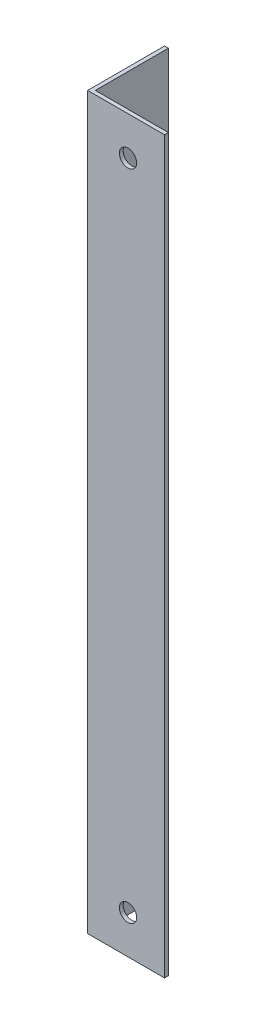
ISO-10303-21;
HEADER;
FILE_DESCRIPTION(('STEP AP214'),'2;1');
FILE_NAME('part.step','',(''),(''),'','','');
FILE_SCHEMA(('AUTOMOTIVE_DESIGN { 1 0 10303 214 1 1 1 1 }'));
ENDSEC;
DATA;
#1=APPLICATION_CONTEXT('core data for automotive mechanical design processes');
#2=APPLICATION_PROTOCOL_DEFINITION('international standard','automotive_design',2000,#1);
#3=PRODUCT_CONTEXT('',#1,'mechanical');
#4=PRODUCT('Part','Part','',(#3));
#5=PRODUCT_RELATED_PRODUCT_CATEGORY('part','',(#4));
#6=PRODUCT_DEFINITION_FORMATION('','',#4);
#7=PRODUCT_DEFINITION_CONTEXT('part definition',#1,'design');
#8=PRODUCT_DEFINITION('design','',#6,#7);
#9=PRODUCT_DEFINITION_SHAPE('','',#8);
#10=(LENGTH_UNIT() NAMED_UNIT(*) SI_UNIT(.MILLI.,.METRE.));
#11=(NAMED_UNIT(*) PLANE_ANGLE_UNIT() SI_UNIT($,.RADIAN.));
#12=(NAMED_UNIT(*) SI_UNIT($,.STERADIAN.) SOLID_ANGLE_UNIT());
#13=UNCERTAINTY_MEASURE_WITH_UNIT(LENGTH_MEASURE(1.E-05),#10,'distance_accuracy_value','');
#14=(GEOMETRIC_REPRESENTATION_CONTEXT(3) GLOBAL_UNCERTAINTY_ASSIGNED_CONTEXT((#13)) GLOBAL_UNIT_ASSIGNED_CONTEXT((#10,
#11,#12)) REPRESENTATION_CONTEXT('',''));
#15=CARTESIAN_POINT('',(0.,0.,0.));
#16=DIRECTION('',(0.,0.,1.));
#17=DIRECTION('',(1.,0.,0.));
#18=AXIS2_PLACEMENT_3D('',#15,#16,#17);
#19=CARTESIAN_POINT('',(20.,190.,0.));
#20=DIRECTION('',(0.,0.,-1.));
#21=DIRECTION('',(-1.,0.,0.));
#22=AXIS2_PLACEMENT_3D('',#19,#20,#21);
#23=PLANE('',#22);
#24=CARTESIAN_POINT('',(10.5,180.,0.));
#25=DIRECTION('',(0.,0.,-1.));
#26=DIRECTION('',(-1.,0.,0.));
#27=AXIS2_PLACEMENT_3D('',#24,#25,#26);
#28=CIRCLE('',#27,2.25);
#29=CARTESIAN_POINT('',(8.25,180.,0.));
#30=VERTEX_POINT('',#29);
#31=EDGE_CURVE('E170',#30,#30,#28,.T.);
#32=ORIENTED_EDGE('',*,*,#31,.T.);
#33=EDGE_LOOP('',(#32));
#34=FACE_BOUND('',#33,.T.);
#35=CARTESIAN_POINT('',(10.5,10.,0.));
#36=DIRECTION('',(0.,0.,-1.));
#37=DIRECTION('',(-1.,0.,0.));
#38=AXIS2_PLACEMENT_3D('',#35,#36,#37);
#39=CIRCLE('',#38,2.25);
#40=CARTESIAN_POINT('',(8.24999999999998,10.,0.));
#41=VERTEX_POINT('',#40);
#42=EDGE_CURVE('E126',#41,#41,#39,.T.);
#43=ORIENTED_EDGE('',*,*,#42,.T.);
#44=EDGE_LOOP('',(#43));
#45=FACE_BOUND('',#44,.T.);
#46=DIRECTION('',(1.,0.,0.));
#47=VECTOR('',#46,1.);
#48=CARTESIAN_POINT('',(20.,0.,0.));
#49=LINE('',#48,#47);
#50=CARTESIAN_POINT('',(0.,0.,0.));
#51=VERTEX_POINT('',#50);
#52=CARTESIAN_POINT('',(20.,0.,0.));
#53=VERTEX_POINT('',#52);
#54=EDGE_CURVE('E122',#51,#53,#49,.T.);
#55=ORIENTED_EDGE('',*,*,#54,.T.);
#56=DIRECTION('',(0.,-1.,0.));
#57=VECTOR('',#56,1.);
#58=CARTESIAN_POINT('',(20.,190.,0.));
#59=LINE('',#58,#57);
#60=CARTESIAN_POINT('',(20.,190.,0.));
#61=VERTEX_POINT('',#60);
#62=EDGE_CURVE('E11',#61,#53,#59,.T.);
#63=ORIENTED_EDGE('',*,*,#62,.F.);
#64=DIRECTION('',(1.,0.,0.));
#65=VECTOR('',#64,1.);
#66=CARTESIAN_POINT('',(20.,190.,0.));
#67=LINE('',#66,#65);
#68=CARTESIAN_POINT('',(0.,190.,0.));
#69=VERTEX_POINT('',#68);
#70=EDGE_CURVE('E133',#69,#61,#67,.T.);
#71=ORIENTED_EDGE('',*,*,#70,.F.);
#72=DIRECTION('',(0.,-1.,0.));
#73=VECTOR('',#72,1.);
#74=CARTESIAN_POINT('',(0.,190.,0.));
#75=LINE('',#74,#73);
#76=EDGE_CURVE('E118',#69,#51,#75,.T.);
#77=ORIENTED_EDGE('',*,*,#76,.T.);
#78=EDGE_LOOP('',(#55,#63,#71,#77));
#79=FACE_BOUND('',#78,.T.);
#80=ADVANCED_FACE('F38',(#34,#45,#79),#23,.F.);
#81=CARTESIAN_POINT('',(20.,190.,-0.999999999999998));
#82=DIRECTION('',(-1.,0.,0.));
#83=DIRECTION('',(0.,0.,1.));
#84=AXIS2_PLACEMENT_3D('',#81,#82,#83);
#85=PLANE('',#84);
#86=DIRECTION('',(0.,0.,-1.));
#87=VECTOR('',#86,1.);
#88=CARTESIAN_POINT('',(20.,0.,-0.999999999999998));
#89=LINE('',#88,#87);
#90=CARTESIAN_POINT('',(20.,0.,-0.999999999999998));
#91=VERTEX_POINT('',#90);
#92=EDGE_CURVE('E125',#53,#91,#89,.T.);
#93=ORIENTED_EDGE('',*,*,#92,.T.);
#94=DIRECTION('',(0.,-1.,0.));
#95=VECTOR('',#94,1.);
#96=CARTESIAN_POINT('',(20.,190.,-0.999999999999998));
#97=LINE('',#96,#95);
#98=CARTESIAN_POINT('',(20.,190.,-0.999999999999998));
#99=VERTEX_POINT('',#98);
#100=EDGE_CURVE('E46',#99,#91,#97,.T.);
#101=ORIENTED_EDGE('',*,*,#100,.F.);
#102=DIRECTION('',(0.,0.,-1.));
#103=VECTOR('',#102,1.);
#104=CARTESIAN_POINT('',(20.,190.,-0.999999999999998));
#105=LINE('',#104,#103);
#106=EDGE_CURVE('E91',#61,#99,#105,.T.);
#107=ORIENTED_EDGE('',*,*,#106,.F.);
#108=ORIENTED_EDGE('',*,*,#62,.T.);
#109=EDGE_LOOP('',(#93,#101,#107,#108));
#110=FACE_BOUND('',#109,.T.);
#111=ADVANCED_FACE('F162',(#110),#85,.F.);
#112=CARTESIAN_POINT('',(1.,190.,-0.999999999999997));
#113=DIRECTION('',(0.,0.,1.));
#114=DIRECTION('',(1.,0.,0.));
#115=AXIS2_PLACEMENT_3D('',#112,#113,#114);
#116=PLANE('',#115);
#117=CARTESIAN_POINT('',(10.5,180.,-0.999999999999998));
#118=DIRECTION('',(0.,0.,-1.));
#119=DIRECTION('',(-1.,0.,0.));
#120=AXIS2_PLACEMENT_3D('',#117,#118,#119);
#121=CIRCLE('',#120,2.25);
#122=CARTESIAN_POINT('',(8.25,180.,-0.999999999999998));
#123=VERTEX_POINT('',#122);
#124=EDGE_CURVE('E179',#123,#123,#121,.T.);
#125=ORIENTED_EDGE('',*,*,#124,.F.);
#126=EDGE_LOOP('',(#125));
#127=FACE_BOUND('',#126,.T.);
#128=CARTESIAN_POINT('',(10.5,10.,-0.999999999999998));
#129=DIRECTION('',(0.,0.,-1.));
#130=DIRECTION('',(-1.,0.,0.));
#131=AXIS2_PLACEMENT_3D('',#128,#129,#130);
#132=CIRCLE('',#131,2.25);
#133=CARTESIAN_POINT('',(8.24999999999998,10.,-0.999999999999998));
#134=VERTEX_POINT('',#133);
#135=EDGE_CURVE('E174',#134,#134,#132,.T.);
#136=ORIENTED_EDGE('',*,*,#135,.F.);
#137=EDGE_LOOP('',(#136));
#138=FACE_BOUND('',#137,.T.);
#139=DIRECTION('',(-1.,0.,0.));
#140=VECTOR('',#139,1.);
#141=CARTESIAN_POINT('',(1.,0.,-0.999999999999997));
#142=LINE('',#141,#140);
#143=CARTESIAN_POINT('',(1.,0.,-0.999999999999997));
#144=VERTEX_POINT('',#143);
#145=EDGE_CURVE('E128',#91,#144,#142,.T.);
#146=ORIENTED_EDGE('',*,*,#145,.T.);
#147=DIRECTION('',(0.,-1.,0.));
#148=VECTOR('',#147,1.);
#149=CARTESIAN_POINT('',(1.,190.,-0.999999999999997));
#150=LINE('',#149,#148);
#151=CARTESIAN_POINT('',(1.,190.,-0.999999999999997));
#152=VERTEX_POINT('',#151);
#153=EDGE_CURVE('E113',#152,#144,#150,.T.);
#154=ORIENTED_EDGE('',*,*,#153,.F.);
#155=DIRECTION('',(-1.,0.,0.));
#156=VECTOR('',#155,1.);
#157=CARTESIAN_POINT('',(1.,190.,-0.999999999999997));
#158=LINE('',#157,#156);
#159=EDGE_CURVE('E104',#99,#152,#158,.T.);
#160=ORIENTED_EDGE('',*,*,#159,.F.);
#161=ORIENTED_EDGE('',*,*,#100,.T.);
#162=EDGE_LOOP('',(#146,#154,#160,#161));
#163=FACE_BOUND('',#162,.T.);
#164=ADVANCED_FACE('F139',(#127,#138,#163),#116,.F.);
#165=CARTESIAN_POINT('',(0.999999999999998,190.,-20.));
#166=DIRECTION('',(-1.,0.,0.));
#167=DIRECTION('',(0.,0.,1.));
#168=AXIS2_PLACEMENT_3D('',#165,#166,#167);
#169=PLANE('',#168);
#170=CARTESIAN_POINT('',(0.999999999999999,122.,-7.00000000000001));
#171=DIRECTION('',(1.,0.,0.));
#172=DIRECTION('',(0.,0.,-1.));
#173=AXIS2_PLACEMENT_3D('',#170,#171,#172);
#174=CIRCLE('',#173,1.60000000000001);
#175=CARTESIAN_POINT('',(0.999999999999999,122.,-8.60000000000002));
#176=VERTEX_POINT('',#175);
#177=EDGE_CURVE('E192',#176,#176,#174,.T.);
#178=ORIENTED_EDGE('',*,*,#177,.F.);
#179=EDGE_LOOP('',(#178));
#180=FACE_BOUND('',#179,.T.);
#181=CARTESIAN_POINT('',(0.999999999999999,155.,-7.));
#182=DIRECTION('',(1.,0.,0.));
#183=DIRECTION('',(0.,0.,-1.));
#184=AXIS2_PLACEMENT_3D('',#181,#182,#183);
#185=CIRCLE('',#184,1.59999999999998);
#186=CARTESIAN_POINT('',(0.999999999999999,155.,-8.59999999999998));
#187=VERTEX_POINT('',#186);
#188=EDGE_CURVE('E186',#187,#187,#185,.T.);
#189=ORIENTED_EDGE('',*,*,#188,.F.);
#190=EDGE_LOOP('',(#189));
#191=FACE_BOUND('',#190,.T.);
#192=DIRECTION('',(0.,0.,-1.));
#193=VECTOR('',#192,1.);
#194=CARTESIAN_POINT('',(0.999999999999998,0.,-20.));
#195=LINE('',#194,#193);
#196=CARTESIAN_POINT('',(0.999999999999998,0.,-20.));
#197=VERTEX_POINT('',#196);
#198=EDGE_CURVE('E112',#144,#197,#195,.T.);
#199=ORIENTED_EDGE('',*,*,#198,.T.);
#200=DIRECTION('',(0.,-1.,0.));
#201=VECTOR('',#200,1.);
#202=CARTESIAN_POINT('',(0.999999999999998,190.,-20.));
#203=LINE('',#202,#201);
#204=CARTESIAN_POINT('',(0.999999999999998,190.,-20.));
#205=VERTEX_POINT('',#204);
#206=EDGE_CURVE('E109',#205,#197,#203,.T.);
#207=ORIENTED_EDGE('',*,*,#206,.F.);
#208=DIRECTION('',(0.,0.,-1.));
#209=VECTOR('',#208,1.);
#210=CARTESIAN_POINT('',(0.999999999999998,190.,-20.));
#211=LINE('',#210,#209);
#212=EDGE_CURVE('E98',#152,#205,#211,.T.);
#213=ORIENTED_EDGE('',*,*,#212,.F.);
#214=ORIENTED_EDGE('',*,*,#153,.T.);
#215=EDGE_LOOP('',(#199,#207,#213,#214));
#216=FACE_BOUND('',#215,.T.);
#217=ADVANCED_FACE('F110',(#180,#191,#216),#169,.F.);
#218=CARTESIAN_POINT('',(0.,190.,-20.));
#219=DIRECTION('',(0.,0.,1.));
#220=DIRECTION('',(1.,0.,0.));
#221=AXIS2_PLACEMENT_3D('',#218,#219,#220);
#222=PLANE('',#221);
#223=DIRECTION('',(-1.,0.,0.));
#224=VECTOR('',#223,1.);
#225=CARTESIAN_POINT('',(0.,0.,-20.));
#226=LINE('',#225,#224);
#227=CARTESIAN_POINT('',(0.,0.,-20.));
#228=VERTEX_POINT('',#227);
#229=EDGE_CURVE('E77',#197,#228,#226,.T.);
#230=ORIENTED_EDGE('',*,*,#229,.T.);
#231=DIRECTION('',(0.,-1.,0.));
#232=VECTOR('',#231,1.);
#233=CARTESIAN_POINT('',(0.,190.,-20.));
#234=LINE('',#233,#232);
#235=CARTESIAN_POINT('',(0.,190.,-20.));
#236=VERTEX_POINT('',#235);
#237=EDGE_CURVE('E114',#236,#228,#234,.T.);
#238=ORIENTED_EDGE('',*,*,#237,.F.);
#239=DIRECTION('',(-1.,0.,0.));
#240=VECTOR('',#239,1.);
#241=CARTESIAN_POINT('',(0.,190.,-20.));
#242=LINE('',#241,#240);
#243=EDGE_CURVE('E102',#205,#236,#242,.T.);
#244=ORIENTED_EDGE('',*,*,#243,.F.);
#245=ORIENTED_EDGE('',*,*,#206,.T.);
#246=EDGE_LOOP('',(#230,#238,#244,#245));
#247=FACE_BOUND('',#246,.T.);
#248=ADVANCED_FACE('F116',(#247),#222,.F.);
#249=CARTESIAN_POINT('',(0.,190.,0.));
#250=DIRECTION('',(1.,0.,0.));
#251=DIRECTION('',(0.,0.,-1.));
#252=AXIS2_PLACEMENT_3D('',#249,#250,#251);
#253=PLANE('',#252);
#254=CARTESIAN_POINT('',(0.,122.,-7.00000000000001));
#255=DIRECTION('',(1.,0.,0.));
#256=DIRECTION('',(0.,0.,-1.));
#257=AXIS2_PLACEMENT_3D('',#254,#255,#256);
#258=CIRCLE('',#257,1.60000000000001);
#259=CARTESIAN_POINT('',(0.,122.,-8.60000000000002));
#260=VERTEX_POINT('',#259);
#261=EDGE_CURVE('E189',#260,#260,#258,.T.);
#262=ORIENTED_EDGE('',*,*,#261,.T.);
#263=EDGE_LOOP('',(#262));
#264=FACE_BOUND('',#263,.T.);
#265=CARTESIAN_POINT('',(0.,155.,-7.));
#266=DIRECTION('',(1.,0.,0.));
#267=DIRECTION('',(0.,0.,-1.));
#268=AXIS2_PLACEMENT_3D('',#265,#266,#267);
#269=CIRCLE('',#268,1.59999999999998);
#270=CARTESIAN_POINT('',(0.,155.,-8.59999999999998));
#271=VERTEX_POINT('',#270);
#272=EDGE_CURVE('E184',#271,#271,#269,.T.);
#273=ORIENTED_EDGE('',*,*,#272,.T.);
#274=EDGE_LOOP('',(#273));
#275=FACE_BOUND('',#274,.T.);
#276=DIRECTION('',(0.,0.,1.));
#277=VECTOR('',#276,1.);
#278=CARTESIAN_POINT('',(0.,0.,0.));
#279=LINE('',#278,#277);
#280=EDGE_CURVE('E83',#228,#51,#279,.T.);
#281=ORIENTED_EDGE('',*,*,#280,.T.);
#282=ORIENTED_EDGE('',*,*,#76,.F.);
#283=DIRECTION('',(0.,0.,1.));
#284=VECTOR('',#283,1.);
#285=CARTESIAN_POINT('',(0.,190.,0.));
#286=LINE('',#285,#284);
#287=EDGE_CURVE('E54',#236,#69,#286,.T.);
#288=ORIENTED_EDGE('',*,*,#287,.F.);
#289=ORIENTED_EDGE('',*,*,#237,.T.);
#290=EDGE_LOOP('',(#281,#282,#288,#289));
#291=FACE_BOUND('',#290,.T.);
#292=ADVANCED_FACE('F146',(#264,#275,#291),#253,.F.);
#293=CARTESIAN_POINT('',(0.,190.,0.));
#294=DIRECTION('',(0.,-1.,0.));
#295=DIRECTION('',(0.,0.,-1.));
#296=AXIS2_PLACEMENT_3D('',#293,#294,#295);
#297=PLANE('',#296);
#298=ORIENTED_EDGE('',*,*,#70,.T.);
#299=ORIENTED_EDGE('',*,*,#106,.T.);
#300=ORIENTED_EDGE('',*,*,#159,.T.);
#301=ORIENTED_EDGE('',*,*,#212,.T.);
#302=ORIENTED_EDGE('',*,*,#243,.T.);
#303=ORIENTED_EDGE('',*,*,#287,.T.);
#304=EDGE_LOOP('',(#298,#299,#300,#301,#302,#303));
#305=FACE_BOUND('',#304,.T.);
#306=ADVANCED_FACE('F100',(#305),#297,.F.);
#307=CARTESIAN_POINT('',(0.,0.,0.));
#308=DIRECTION('',(0.,-1.,0.));
#309=DIRECTION('',(0.,0.,-1.));
#310=AXIS2_PLACEMENT_3D('',#307,#308,#309);
#311=PLANE('',#310);
#312=ORIENTED_EDGE('',*,*,#54,.F.);
#313=ORIENTED_EDGE('',*,*,#280,.F.);
#314=ORIENTED_EDGE('',*,*,#229,.F.);
#315=ORIENTED_EDGE('',*,*,#198,.F.);
#316=ORIENTED_EDGE('',*,*,#145,.F.);
#317=ORIENTED_EDGE('',*,*,#92,.F.);
#318=EDGE_LOOP('',(#312,#313,#314,#315,#316,#317));
#319=FACE_BOUND('',#318,.T.);
#320=ADVANCED_FACE('F142',(#319),#311,.T.);
#321=CARTESIAN_POINT('',(10.5,10.,0.));
#322=DIRECTION('',(0.,0.,-1.));
#323=DIRECTION('',(-1.,0.,0.));
#324=AXIS2_PLACEMENT_3D('',#321,#322,#323);
#325=CYLINDRICAL_SURFACE('',#324,2.25);
#326=ORIENTED_EDGE('',*,*,#42,.F.);
#327=EDGE_LOOP('',(#326));
#328=FACE_BOUND('',#327,.T.);
#329=ORIENTED_EDGE('',*,*,#135,.T.);
#330=EDGE_LOOP('',(#329));
#331=FACE_BOUND('',#330,.T.);
#332=ADVANCED_FACE('F214',(#328,#331),#325,.F.);
#333=CARTESIAN_POINT('',(10.5,180.,0.));
#334=DIRECTION('',(0.,0.,-1.));
#335=DIRECTION('',(-1.,0.,0.));
#336=AXIS2_PLACEMENT_3D('',#333,#334,#335);
#337=CYLINDRICAL_SURFACE('',#336,2.25);
#338=ORIENTED_EDGE('',*,*,#31,.F.);
#339=EDGE_LOOP('',(#338));
#340=FACE_BOUND('',#339,.T.);
#341=ORIENTED_EDGE('',*,*,#124,.T.);
#342=EDGE_LOOP('',(#341));
#343=FACE_BOUND('',#342,.T.);
#344=ADVANCED_FACE('F209',(#340,#343),#337,.F.);
#345=CARTESIAN_POINT('',(0.,155.,-7.));
#346=DIRECTION('',(1.,0.,0.));
#347=DIRECTION('',(0.,0.,-1.));
#348=AXIS2_PLACEMENT_3D('',#345,#346,#347);
#349=CYLINDRICAL_SURFACE('',#348,1.59999999999998);
#350=ORIENTED_EDGE('',*,*,#272,.F.);
#351=EDGE_LOOP('',(#350));
#352=FACE_BOUND('',#351,.T.);
#353=ORIENTED_EDGE('',*,*,#188,.T.);
#354=EDGE_LOOP('',(#353));
#355=FACE_BOUND('',#354,.T.);
#356=ADVANCED_FACE('F200',(#352,#355),#349,.F.);
#357=CARTESIAN_POINT('',(0.,122.,-7.00000000000001));
#358=DIRECTION('',(1.,0.,0.));
#359=DIRECTION('',(0.,0.,-1.));
#360=AXIS2_PLACEMENT_3D('',#357,#358,#359);
#361=CYLINDRICAL_SURFACE('',#360,1.60000000000001);
#362=ORIENTED_EDGE('',*,*,#261,.F.);
#363=EDGE_LOOP('',(#362));
#364=FACE_BOUND('',#363,.T.);
#365=ORIENTED_EDGE('',*,*,#177,.T.);
#366=EDGE_LOOP('',(#365));
#367=FACE_BOUND('',#366,.T.);
#368=ADVANCED_FACE('F197',(#364,#367),#361,.F.);
#369=CLOSED_SHELL('',(#80,#111,#164,#217,#248,#292,#306,#320,#332,#344,#356,#368));
#370=MANIFOLD_SOLID_BREP('B2',#369);
#371=ADVANCED_BREP_SHAPE_REPRESENTATION('',(#18,#370),#14);
#372=SHAPE_DEFINITION_REPRESENTATION(#9,#371);
ENDSEC;
END-ISO-10303-21;
